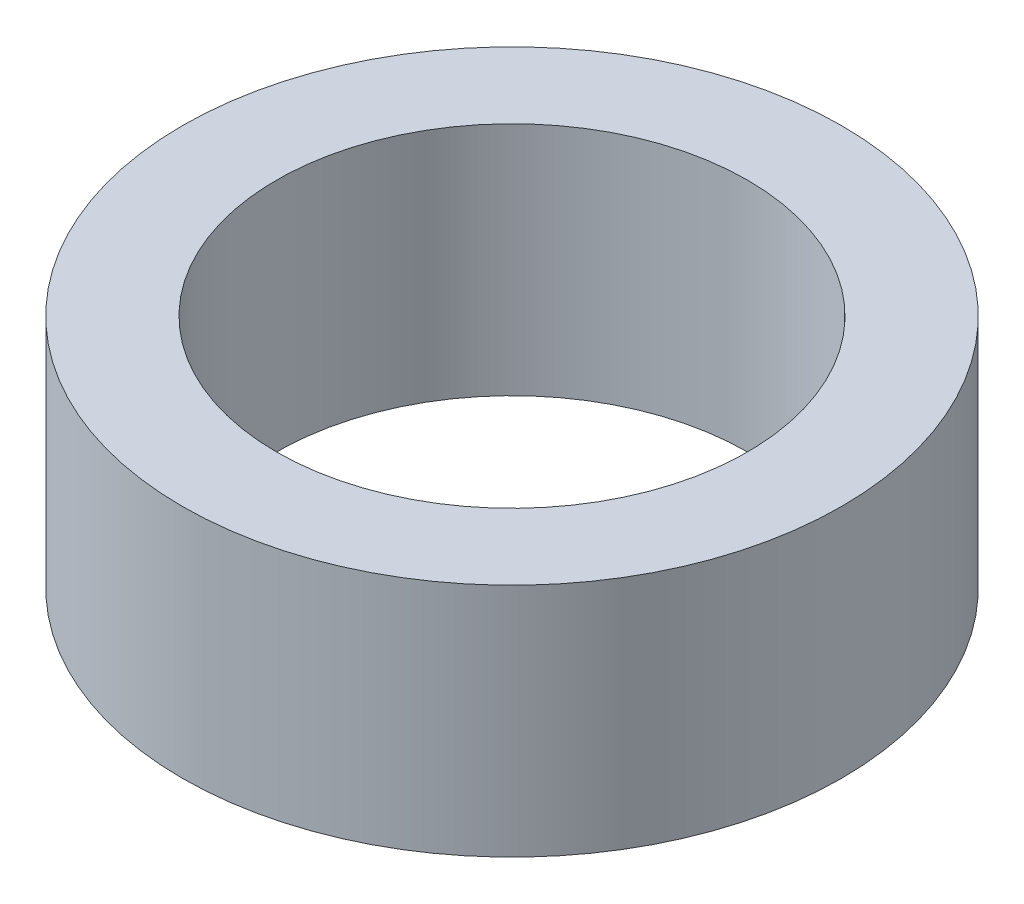
ISO-10303-21;
HEADER;
FILE_DESCRIPTION(('STEP AP214'),'2;1');
FILE_NAME('part.step','',(''),(''),'','','');
FILE_SCHEMA(('AUTOMOTIVE_DESIGN { 1 0 10303 214 1 1 1 1 }'));
ENDSEC;
DATA;
#1=APPLICATION_CONTEXT('core data for automotive mechanical design processes');
#2=APPLICATION_PROTOCOL_DEFINITION('international standard','automotive_design',2000,#1);
#3=PRODUCT_CONTEXT('',#1,'mechanical');
#4=PRODUCT('Part','Part','',(#3));
#5=PRODUCT_RELATED_PRODUCT_CATEGORY('part','',(#4));
#6=PRODUCT_DEFINITION_FORMATION('','',#4);
#7=PRODUCT_DEFINITION_CONTEXT('part definition',#1,'design');
#8=PRODUCT_DEFINITION('design','',#6,#7);
#9=PRODUCT_DEFINITION_SHAPE('','',#8);
#10=(LENGTH_UNIT() NAMED_UNIT(*) SI_UNIT(.MILLI.,.METRE.));
#11=(NAMED_UNIT(*) PLANE_ANGLE_UNIT() SI_UNIT($,.RADIAN.));
#12=(NAMED_UNIT(*) SI_UNIT($,.STERADIAN.) SOLID_ANGLE_UNIT());
#13=UNCERTAINTY_MEASURE_WITH_UNIT(LENGTH_MEASURE(1.E-05),#10,'distance_accuracy_value','');
#14=(GEOMETRIC_REPRESENTATION_CONTEXT(3) GLOBAL_UNCERTAINTY_ASSIGNED_CONTEXT((#13)) GLOBAL_UNIT_ASSIGNED_CONTEXT((#10,
#11,#12)) REPRESENTATION_CONTEXT('',''));
#15=CARTESIAN_POINT('',(0.,0.,0.));
#16=DIRECTION('',(0.,0.,1.));
#17=DIRECTION('',(1.,0.,0.));
#18=AXIS2_PLACEMENT_3D('',#15,#16,#17);
#19=CARTESIAN_POINT('',(0.,0.,0.));
#20=DIRECTION('',(0.,1.,0.));
#21=DIRECTION('',(0.,0.,1.));
#22=AXIS2_PLACEMENT_3D('',#19,#20,#21);
#23=CYLINDRICAL_SURFACE('',#22,3.175);
#24=CARTESIAN_POINT('',(0.,0.,0.));
#25=DIRECTION('',(0.,1.,0.));
#26=DIRECTION('',(0.,0.,1.));
#27=AXIS2_PLACEMENT_3D('',#24,#25,#26);
#28=CIRCLE('',#27,3.175);
#29=CARTESIAN_POINT('',(0.,0.,3.175));
#30=VERTEX_POINT('',#29);
#31=EDGE_CURVE('E54',#30,#30,#28,.T.);
#32=ORIENTED_EDGE('',*,*,#31,.T.);
#33=EDGE_LOOP('',(#32));
#34=FACE_BOUND('',#33,.T.);
#35=CARTESIAN_POINT('',(0.,-3.175,0.));
#36=DIRECTION('',(0.,1.,0.));
#37=DIRECTION('',(0.,0.,1.));
#38=AXIS2_PLACEMENT_3D('',#35,#36,#37);
#39=CIRCLE('',#38,3.175);
#40=CARTESIAN_POINT('',(0.,-3.175,3.175));
#41=VERTEX_POINT('',#40);
#42=EDGE_CURVE('E10',#41,#41,#39,.T.);
#43=ORIENTED_EDGE('',*,*,#42,.F.);
#44=EDGE_LOOP('',(#43));
#45=FACE_BOUND('',#44,.T.);
#46=ADVANCED_FACE('F37',(#34,#45),#23,.F.);
#47=CARTESIAN_POINT('',(-3.175,-3.175,0.));
#48=DIRECTION('',(0.,-1.,0.));
#49=DIRECTION('',(0.,0.,-1.));
#50=AXIS2_PLACEMENT_3D('',#47,#48,#49);
#51=PLANE('',#50);
#52=ORIENTED_EDGE('',*,*,#42,.T.);
#53=EDGE_LOOP('',(#52));
#54=FACE_BOUND('',#53,.T.);
#55=CARTESIAN_POINT('',(0.,-3.175,0.));
#56=DIRECTION('',(0.,1.,0.));
#57=DIRECTION('',(0.,0.,1.));
#58=AXIS2_PLACEMENT_3D('',#55,#56,#57);
#59=CIRCLE('',#58,4.445);
#60=CARTESIAN_POINT('',(0.,-3.175,4.445));
#61=VERTEX_POINT('',#60);
#62=EDGE_CURVE('E44',#61,#61,#59,.T.);
#63=ORIENTED_EDGE('',*,*,#62,.F.);
#64=EDGE_LOOP('',(#63));
#65=FACE_BOUND('',#64,.T.);
#66=ADVANCED_FACE('F71',(#54,#65),#51,.T.);
#67=CARTESIAN_POINT('',(0.,0.,0.));
#68=DIRECTION('',(0.,1.,0.));
#69=DIRECTION('',(0.,0.,1.));
#70=AXIS2_PLACEMENT_3D('',#67,#68,#69);
#71=CYLINDRICAL_SURFACE('',#70,4.445);
#72=ORIENTED_EDGE('',*,*,#62,.T.);
#73=EDGE_LOOP('',(#72));
#74=FACE_BOUND('',#73,.T.);
#75=CARTESIAN_POINT('',(0.,0.,0.));
#76=DIRECTION('',(0.,1.,0.));
#77=DIRECTION('',(0.,0.,1.));
#78=AXIS2_PLACEMENT_3D('',#75,#76,#77);
#79=CIRCLE('',#78,4.445);
#80=CARTESIAN_POINT('',(0.,0.,4.445));
#81=VERTEX_POINT('',#80);
#82=EDGE_CURVE('E49',#81,#81,#79,.T.);
#83=ORIENTED_EDGE('',*,*,#82,.F.);
#84=EDGE_LOOP('',(#83));
#85=FACE_BOUND('',#84,.T.);
#86=ADVANCED_FACE('F65',(#74,#85),#71,.T.);
#87=CARTESIAN_POINT('',(-3.175,0.,0.));
#88=DIRECTION('',(0.,1.,0.));
#89=DIRECTION('',(0.,0.,1.));
#90=AXIS2_PLACEMENT_3D('',#87,#88,#89);
#91=PLANE('',#90);
#92=ORIENTED_EDGE('',*,*,#82,.T.);
#93=EDGE_LOOP('',(#92));
#94=FACE_BOUND('',#93,.T.);
#95=ORIENTED_EDGE('',*,*,#31,.F.);
#96=EDGE_LOOP('',(#95));
#97=FACE_BOUND('',#96,.T.);
#98=ADVANCED_FACE('F63',(#94,#97),#91,.T.);
#99=CLOSED_SHELL('',(#46,#66,#86,#98));
#100=MANIFOLD_SOLID_BREP('B2',#99);
#101=ADVANCED_BREP_SHAPE_REPRESENTATION('',(#18,#100),#14);
#102=SHAPE_DEFINITION_REPRESENTATION(#9,#101);
ENDSEC;
END-ISO-10303-21;
